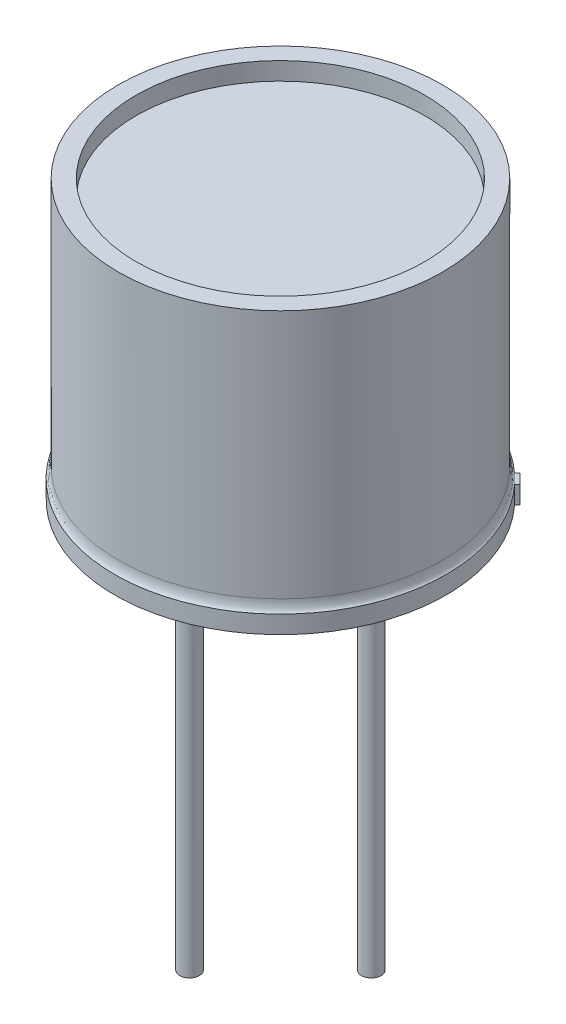
ISO-10303-21;
HEADER;
FILE_DESCRIPTION(('STEP AP214'),'2;1');
FILE_NAME('part.step','',(''),(''),'','','');
FILE_SCHEMA(('AUTOMOTIVE_DESIGN { 1 0 10303 214 1 1 1 1 }'));
ENDSEC;
DATA;
#1=APPLICATION_CONTEXT('core data for automotive mechanical design processes');
#2=APPLICATION_PROTOCOL_DEFINITION('international standard','automotive_design',2000,#1);
#3=PRODUCT_CONTEXT('',#1,'mechanical');
#4=PRODUCT('Part','Part','',(#3));
#5=PRODUCT_RELATED_PRODUCT_CATEGORY('part','',(#4));
#6=PRODUCT_DEFINITION_FORMATION('','',#4);
#7=PRODUCT_DEFINITION_CONTEXT('part definition',#1,'design');
#8=PRODUCT_DEFINITION('design','',#6,#7);
#9=PRODUCT_DEFINITION_SHAPE('','',#8);
#10=(LENGTH_UNIT() NAMED_UNIT(*) SI_UNIT(.MILLI.,.METRE.));
#11=(NAMED_UNIT(*) PLANE_ANGLE_UNIT() SI_UNIT($,.RADIAN.));
#12=(NAMED_UNIT(*) SI_UNIT($,.STERADIAN.) SOLID_ANGLE_UNIT());
#13=UNCERTAINTY_MEASURE_WITH_UNIT(LENGTH_MEASURE(1.E-05),#10,'distance_accuracy_value','');
#14=(GEOMETRIC_REPRESENTATION_CONTEXT(3) GLOBAL_UNCERTAINTY_ASSIGNED_CONTEXT((#13)) GLOBAL_UNIT_ASSIGNED_CONTEXT((#10,
#11,#12)) REPRESENTATION_CONTEXT('',''));
#15=CARTESIAN_POINT('',(0.,0.,0.));
#16=DIRECTION('',(0.,0.,1.));
#17=DIRECTION('',(1.,0.,0.));
#18=AXIS2_PLACEMENT_3D('',#15,#16,#17);
#19=CARTESIAN_POINT('',(0.,7.8,0.));
#20=DIRECTION('',(0.,-1.,0.));
#21=DIRECTION('',(0.,0.,-1.));
#22=AXIS2_PLACEMENT_3D('',#19,#20,#21);
#23=CYLINDRICAL_SURFACE('',#22,4.55);
#24=CARTESIAN_POINT('',(0.,0.8,-4.55));
#25=CARTESIAN_POINT('',(0.595593602652286,0.8,-4.55));
#26=CARTESIAN_POINT('',(1.19095287807611,0.8,-4.431575677084));
#27=CARTESIAN_POINT('',(2.2914663564462,0.8,-3.97572806876871));
#28=CARTESIAN_POINT('',(2.79618757913212,0.8,-3.63848412966547));
#29=CARTESIAN_POINT('',(3.63848412966547,0.8,-2.79618757913212));
#30=CARTESIAN_POINT('',(3.97572806876872,0.8,-2.2914663564462));
#31=CARTESIAN_POINT('',(4.431575677084,0.8,-1.19095287807611));
#32=CARTESIAN_POINT('',(4.55,0.8,-0.595593602652218));
#33=CARTESIAN_POINT('',(4.55,0.8,0.595593602652217));
#34=CARTESIAN_POINT('',(4.43157567708403,0.8,1.19095287807602));
#35=CARTESIAN_POINT('',(3.97572806876867,0.8,2.2914663564463));
#36=CARTESIAN_POINT('',(3.63848412966563,0.8,2.79618757913195));
#37=CARTESIAN_POINT('',(2.79618757913194,0.8,3.63848412966564));
#38=CARTESIAN_POINT('',(2.29146635644623,0.8,3.9757280687687));
#39=CARTESIAN_POINT('',(1.19095287807609,0.8,4.431575677084));
#40=CARTESIAN_POINT('',(0.595593602652218,0.8,4.55));
#41=CARTESIAN_POINT('',(-0.595593602652217,0.8,4.55));
#42=CARTESIAN_POINT('',(-1.19095287807599,0.8,4.43157567708405));
#43=CARTESIAN_POINT('',(-2.29146635644632,0.8,3.97572806876867));
#44=CARTESIAN_POINT('',(-2.79618757913195,0.8,3.63848412966563));
#45=CARTESIAN_POINT('',(-3.63848412966564,0.8,2.79618757913194));
#46=CARTESIAN_POINT('',(-3.9757280687687,0.8,2.29146635644623));
#47=CARTESIAN_POINT('',(-4.43157567708401,0.8,1.19095287807609));
#48=CARTESIAN_POINT('',(-4.55,0.8,0.595593602652211));
#49=CARTESIAN_POINT('',(-4.55,0.8,-0.595593602652225));
#50=CARTESIAN_POINT('',(-4.43157567708405,0.8,-1.19095287807599));
#51=CARTESIAN_POINT('',(-3.97572806876867,0.8,-2.29146635644632));
#52=CARTESIAN_POINT('',(-3.63848412966538,0.8,-2.7961875791322));
#53=CARTESIAN_POINT('',(-2.79618757913222,0.8,-3.63848412966536));
#54=CARTESIAN_POINT('',(-2.29146635644623,0.8,-3.9757280687687));
#55=CARTESIAN_POINT('',(-1.19095287807609,0.8,-4.43157567708401));
#56=CARTESIAN_POINT('',(-0.595593602652287,0.8,-4.55));
#57=CARTESIAN_POINT('',(0.,0.8,-4.55));
#58=(BOUNDED_CURVE() B_SPLINE_CURVE(3,(#24,#25,#26,#27,#28,#29,#30,#31,#32,#33,#34,#35,#36,#37,
#38,#39,#40,#41,#42,#43,#44,#45,#46,#47,#48,#49,#50,#51,#52,#53,#54,#55,#56,#57),.UNSPECIFIED.,
.T.,.F.) B_SPLINE_CURVE_WITH_KNOTS((4,2,2,2,2,2,2,2,2,2,2,2,2,2,2,2,4),(0.,0.392699081698724,
0.785398163397448,1.17809724509617,1.5707963267949,1.96349540849362,2.35619449019234,
2.74889357189107,3.14159265358979,3.53429173528852,3.92699081698724,4.31968989868597,
4.71238898038469,5.10508806208341,5.49778714378214,5.89048622548086,6.28318530717959),
.UNSPECIFIED.) CURVE() GEOMETRIC_REPRESENTATION_ITEM() RATIONAL_B_SPLINE_CURVE((1.,1.,1.,1.,1.,
1.,1.,1.,1.,1.,1.,1.,1.,1.,1.,1.,1.,1.,1.,1.,1.,1.,1.,1.,1.,1.,1.,1.,1.,1.,1.,1.,1.,1.)) REPRESENTATION_ITEM(''));
#59=CARTESIAN_POINT('',(0.,0.8,-4.55));
#60=VERTEX_POINT('',#59);
#61=EDGE_CURVE('E12',#60,#60,#58,.F.);
#62=ORIENTED_EDGE('',*,*,#61,.T.);
#63=EDGE_LOOP('',(#62));
#64=FACE_BOUND('',#63,.T.);
#65=CARTESIAN_POINT('',(0.,7.8,0.));
#66=DIRECTION('',(0.,1.,0.));
#67=DIRECTION('',(0.,0.,1.));
#68=AXIS2_PLACEMENT_3D('',#65,#66,#67);
#69=CIRCLE('',#68,4.55);
#70=CARTESIAN_POINT('',(0.,7.8,4.55));
#71=VERTEX_POINT('',#70);
#72=EDGE_CURVE('E195',#71,#71,#69,.T.);
#73=ORIENTED_EDGE('',*,*,#72,.F.);
#74=EDGE_LOOP('',(#73));
#75=FACE_BOUND('',#74,.T.);
#76=ADVANCED_FACE('F40',(#64,#75),#23,.T.);
#77=CARTESIAN_POINT('',(0.,7.8,0.));
#78=DIRECTION('',(0.,1.,0.));
#79=DIRECTION('',(0.,0.,1.));
#80=AXIS2_PLACEMENT_3D('',#77,#78,#79);
#81=PLANE('',#80);
#82=CARTESIAN_POINT('',(0.,7.8,0.));
#83=DIRECTION('',(0.,1.,0.));
#84=DIRECTION('',(0.,0.,1.));
#85=AXIS2_PLACEMENT_3D('',#82,#83,#84);
#86=CIRCLE('',#85,4.050000028);
#87=CARTESIAN_POINT('',(0.,7.8,4.050000028));
#88=VERTEX_POINT('',#87);
#89=EDGE_CURVE('E199',#88,#88,#86,.T.);
#90=ORIENTED_EDGE('',*,*,#89,.F.);
#91=EDGE_LOOP('',(#90));
#92=FACE_BOUND('',#91,.T.);
#93=ORIENTED_EDGE('',*,*,#72,.T.);
#94=EDGE_LOOP('',(#93));
#95=FACE_BOUND('',#94,.T.);
#96=ADVANCED_FACE('F239',(#92,#95),#81,.T.);
#97=CARTESIAN_POINT('',(0.,7.3,0.));
#98=DIRECTION('',(0.,1.,0.));
#99=DIRECTION('',(0.,0.,1.));
#100=AXIS2_PLACEMENT_3D('',#97,#98,#99);
#101=CYLINDRICAL_SURFACE('',#100,4.050000028);
#102=CARTESIAN_POINT('',(0.,7.3,0.));
#103=DIRECTION('',(0.,1.,0.));
#104=DIRECTION('',(0.,0.,1.));
#105=AXIS2_PLACEMENT_3D('',#102,#103,#104);
#106=CIRCLE('',#105,4.050000028);
#107=CARTESIAN_POINT('',(0.,7.3,4.050000028));
#108=VERTEX_POINT('',#107);
#109=EDGE_CURVE('E198',#108,#108,#106,.T.);
#110=ORIENTED_EDGE('',*,*,#109,.F.);
#111=EDGE_LOOP('',(#110));
#112=FACE_BOUND('',#111,.T.);
#113=ORIENTED_EDGE('',*,*,#89,.T.);
#114=EDGE_LOOP('',(#113));
#115=FACE_BOUND('',#114,.T.);
#116=ADVANCED_FACE('F243',(#112,#115),#101,.F.);
#117=CARTESIAN_POINT('',(0.,7.3,0.));
#118=DIRECTION('',(0.,1.,0.));
#119=DIRECTION('',(0.,0.,1.));
#120=AXIS2_PLACEMENT_3D('',#117,#118,#119);
#121=PLANE('',#120);
#122=ORIENTED_EDGE('',*,*,#109,.T.);
#123=EDGE_LOOP('',(#122));
#124=FACE_BOUND('',#123,.T.);
#125=ADVANCED_FACE('F148',(#124),#121,.T.);
#126=CARTESIAN_POINT('',(0.,0.5,0.));
#127=DIRECTION('',(0.,-1.,0.));
#128=DIRECTION('',(0.,0.,-1.));
#129=AXIS2_PLACEMENT_3D('',#126,#127,#128);
#130=CYLINDRICAL_SURFACE('',#129,4.65);
#131=DIRECTION('',(0.,-1.,0.));
#132=VECTOR('',#131,1.);
#133=CARTESIAN_POINT('',(3.14358274395477,0.5,-3.42642489074397));
#134=LINE('',#133,#132);
#135=CARTESIAN_POINT('',(3.14358274395477,0.,-3.42642489074397));
#136=VERTEX_POINT('',#135);
#137=CARTESIAN_POINT('',(3.14356671692941,0.5,-3.42641014549825));
#138=VERTEX_POINT('',#137);
#139=EDGE_CURVE('E66',#136,#138,#134,.F.);
#140=ORIENTED_EDGE('',*,*,#139,.F.);
#141=CARTESIAN_POINT('',(0.,0.,0.));
#142=DIRECTION('',(0.,-1.,0.));
#143=DIRECTION('',(0.,0.,-1.));
#144=AXIS2_PLACEMENT_3D('',#141,#142,#143);
#145=CIRCLE('',#144,4.65);
#146=CARTESIAN_POINT('',(3.42642489074397,0.,-3.14358274395477));
#147=VERTEX_POINT('',#146);
#148=EDGE_CURVE('E61',#147,#136,#145,.T.);
#149=ORIENTED_EDGE('',*,*,#148,.F.);
#150=DIRECTION('',(0.,-1.,0.));
#151=VECTOR('',#150,1.);
#152=CARTESIAN_POINT('',(3.42642489074397,0.5,-3.14358274395477));
#153=LINE('',#152,#151);
#154=CARTESIAN_POINT('',(3.42640953219442,0.5,-3.14356738540522));
#155=VERTEX_POINT('',#154);
#156=EDGE_CURVE('E125',#155,#147,#153,.T.);
#157=ORIENTED_EDGE('',*,*,#156,.F.);
#158=CARTESIAN_POINT('',(0.,0.5,-4.65));
#159=CARTESIAN_POINT('',(-0.608683571941348,0.5,-4.65));
#160=CARTESIAN_POINT('',(-1.21712766660527,0.5,-4.52897294471207));
#161=CARTESIAN_POINT('',(-2.34182825439008,0.5,-4.06310670764289));
#162=CARTESIAN_POINT('',(-2.85764225120103,0.5,-3.71845081383387));
#163=CARTESIAN_POINT('',(-3.71845081383389,0.5,-2.85764225120101));
#164=CARTESIAN_POINT('',(-4.06310670764263,0.5,-2.34182825439013));
#165=CARTESIAN_POINT('',(-4.52897294471234,0.5,-1.21712766660519));
#166=CARTESIAN_POINT('',(-4.65,0.5,-0.608683571941285));
#167=CARTESIAN_POINT('',(-4.65,0.5,0.608683571941271));
#168=CARTESIAN_POINT('',(-4.52897294471207,0.5,1.21712766660527));
#169=CARTESIAN_POINT('',(-4.06310670764289,0.5,2.34182825439008));
#170=CARTESIAN_POINT('',(-3.71845081383401,0.5,2.85764225120075));
#171=CARTESIAN_POINT('',(-2.85764225120089,0.5,3.71845081383414));
#172=CARTESIAN_POINT('',(-2.34182825439013,0.5,4.06310670764263));
#173=CARTESIAN_POINT('',(-1.21712766660519,0.5,4.52897294471234));
#174=CARTESIAN_POINT('',(-0.608683571941277,0.5,4.65));
#175=CARTESIAN_POINT('',(0.608683571941278,0.5,4.65));
#176=CARTESIAN_POINT('',(1.21712766660527,0.5,4.52897294471207));
#177=CARTESIAN_POINT('',(2.34182825439008,0.5,4.06310670764289));
#178=CARTESIAN_POINT('',(2.85764225120088,0.5,3.71845081383414));
#179=CARTESIAN_POINT('',(3.71845081383401,0.5,2.85764225120075));
#180=CARTESIAN_POINT('',(4.0631067076426,0.5,2.34182825439008));
#181=CARTESIAN_POINT('',(4.52897294471236,0.5,1.21712766660525));
#182=CARTESIAN_POINT('',(4.65,0.5,0.608683571941277));
#183=CARTESIAN_POINT('',(4.65,0.5,-0.608683571941278));
#184=CARTESIAN_POINT('',(4.5289729447121,0.5,-1.21712766660525));
#185=CARTESIAN_POINT('',(4.06310670764287,0.5,-2.34182825439008));
#186=CARTESIAN_POINT('',(3.71845081383396,0.5,-2.85764225120093));
#187=CARTESIAN_POINT('',(2.85764225120093,0.5,-3.71845081383396));
#188=CARTESIAN_POINT('',(2.34182825439008,0.5,-4.06310670764287));
#189=CARTESIAN_POINT('',(1.21712766660525,0.5,-4.5289729447121));
#190=CARTESIAN_POINT('',(0.608683571941347,0.5,-4.65));
#191=CARTESIAN_POINT('',(0.,0.5,-4.65));
#192=(BOUNDED_CURVE() B_SPLINE_CURVE(3,(#158,#159,#160,#161,#162,#163,#164,#165,#166,#167,#168,
#169,#170,#171,#172,#173,#174,#175,#176,#177,#178,#179,#180,#181,#182,#183,#184,#185,#186,#187,
#188,#189,#190,#191),.UNSPECIFIED.,.T.,.F.) B_SPLINE_CURVE_WITH_KNOTS((4,2,2,2,2,2,2,2,2,2,2,2,
2,2,2,2,4),(0.,0.392699081698725,0.785398163397448,1.17809724509617,1.5707963267949,
1.96349540849362,2.35619449019234,2.74889357189107,3.14159265358979,3.53429173528852,
3.92699081698724,4.31968989868597,4.71238898038469,5.10508806208341,5.49778714378214,
5.89048622548086,6.28318530717959),
.UNSPECIFIED.) CURVE() GEOMETRIC_REPRESENTATION_ITEM() RATIONAL_B_SPLINE_CURVE((1.,1.,1.,1.,1.,
1.,1.,1.,1.,1.,1.,1.,1.,1.,1.,1.,1.,1.,1.,1.,1.,1.,1.,1.,1.,1.,1.,1.,1.,1.,1.,1.,1.,1.)) REPRESENTATION_ITEM(''));
#193=EDGE_CURVE('E163',#155,#138,#192,.F.);
#194=ORIENTED_EDGE('',*,*,#193,.T.);
#195=EDGE_LOOP('',(#140,#149,#157,#194));
#196=FACE_BOUND('',#195,.T.);
#197=ADVANCED_FACE('F143',(#196),#130,.T.);
#198=CARTESIAN_POINT('',(0.,-10.16,-2.55));
#199=DIRECTION('',(0.,-1.,0.));
#200=DIRECTION('',(0.,0.,-1.));
#201=AXIS2_PLACEMENT_3D('',#198,#199,#200);
#202=PLANE('',#201);
#203=CARTESIAN_POINT('',(0.,-10.16,-2.55));
#204=DIRECTION('',(0.,-1.,0.));
#205=DIRECTION('',(0.,0.,-1.));
#206=AXIS2_PLACEMENT_3D('',#203,#204,#205);
#207=CIRCLE('',#206,0.275);
#208=CARTESIAN_POINT('',(0.,-10.16,-2.825));
#209=VERTEX_POINT('',#208);
#210=EDGE_CURVE('E202',#209,#209,#207,.T.);
#211=ORIENTED_EDGE('',*,*,#210,.T.);
#212=EDGE_LOOP('',(#211));
#213=FACE_BOUND('',#212,.T.);
#214=ADVANCED_FACE('F147',(#213),#202,.T.);
#215=CARTESIAN_POINT('',(-2.55000000000007,-10.16,0.));
#216=DIRECTION('',(0.,-1.,0.));
#217=DIRECTION('',(0.,0.,-1.));
#218=AXIS2_PLACEMENT_3D('',#215,#216,#217);
#219=PLANE('',#218);
#220=CARTESIAN_POINT('',(-2.55000000000007,-10.16,0.));
#221=DIRECTION('',(0.,-1.,0.));
#222=DIRECTION('',(0.,0.,-1.));
#223=AXIS2_PLACEMENT_3D('',#220,#221,#222);
#224=CIRCLE('',#223,0.275000000000056);
#225=CARTESIAN_POINT('',(-2.55000000000007,-10.16,-0.275000000000128));
#226=VERTEX_POINT('',#225);
#227=EDGE_CURVE('E207',#226,#226,#224,.T.);
#228=ORIENTED_EDGE('',*,*,#227,.T.);
#229=EDGE_LOOP('',(#228));
#230=FACE_BOUND('',#229,.T.);
#231=ADVANCED_FACE('F264',(#230),#219,.T.);
#232=CARTESIAN_POINT('',(-1.44326148227495E-13,-10.16,2.55));
#233=DIRECTION('',(0.,-1.,0.));
#234=DIRECTION('',(0.,0.,-1.));
#235=AXIS2_PLACEMENT_3D('',#232,#233,#234);
#236=PLANE('',#235);
#237=CARTESIAN_POINT('',(-1.44326148227495E-13,-10.16,2.55));
#238=DIRECTION('',(0.,-1.,0.));
#239=DIRECTION('',(0.,0.,-1.));
#240=AXIS2_PLACEMENT_3D('',#237,#238,#239);
#241=CIRCLE('',#240,0.275000000000155);
#242=CARTESIAN_POINT('',(-1.44326148227495E-13,-10.16,2.27499999999984));
#243=VERTEX_POINT('',#242);
#244=EDGE_CURVE('E210',#243,#243,#241,.T.);
#245=ORIENTED_EDGE('',*,*,#244,.T.);
#246=EDGE_LOOP('',(#245));
#247=FACE_BOUND('',#246,.T.);
#248=ADVANCED_FACE('F271',(#247),#236,.T.);
#249=CARTESIAN_POINT('',(2.54999999999993,-10.16,0.));
#250=DIRECTION('',(0.,-1.,0.));
#251=DIRECTION('',(0.,0.,-1.));
#252=AXIS2_PLACEMENT_3D('',#249,#250,#251);
#253=PLANE('',#252);
#254=CARTESIAN_POINT('',(2.54999999999993,-10.16,0.));
#255=DIRECTION('',(0.,-1.,0.));
#256=DIRECTION('',(0.,0.,-1.));
#257=AXIS2_PLACEMENT_3D('',#254,#255,#256);
#258=CIRCLE('',#257,0.275000000000116);
#259=CARTESIAN_POINT('',(2.54999999999993,-10.16,-0.275000000000044));
#260=VERTEX_POINT('',#259);
#261=EDGE_CURVE('E166',#260,#260,#258,.T.);
#262=ORIENTED_EDGE('',*,*,#261,.T.);
#263=EDGE_LOOP('',(#262));
#264=FACE_BOUND('',#263,.T.);
#265=ADVANCED_FACE('F149',(#264),#253,.T.);
#266=CARTESIAN_POINT('',(0.,-10.16,-2.55));
#267=DIRECTION('',(0.,1.,0.));
#268=DIRECTION('',(0.,0.,1.));
#269=AXIS2_PLACEMENT_3D('',#266,#267,#268);
#270=CYLINDRICAL_SURFACE('',#269,0.275);
#271=ORIENTED_EDGE('',*,*,#210,.F.);
#272=EDGE_LOOP('',(#271));
#273=FACE_BOUND('',#272,.T.);
#274=CARTESIAN_POINT('',(0.,0.,-2.55));
#275=DIRECTION('',(0.,1.,0.));
#276=DIRECTION('',(0.,0.,1.));
#277=AXIS2_PLACEMENT_3D('',#274,#275,#276);
#278=CIRCLE('',#277,0.275);
#279=CARTESIAN_POINT('',(0.,0.,-2.275));
#280=VERTEX_POINT('',#279);
#281=EDGE_CURVE('E192',#280,#280,#278,.F.);
#282=ORIENTED_EDGE('',*,*,#281,.T.);
#283=EDGE_LOOP('',(#282));
#284=FACE_BOUND('',#283,.T.);
#285=ADVANCED_FACE('F257',(#273,#284),#270,.T.);
#286=CARTESIAN_POINT('',(-2.55000000000007,-10.16,0.));
#287=DIRECTION('',(0.,1.,0.));
#288=DIRECTION('',(0.,0.,1.));
#289=AXIS2_PLACEMENT_3D('',#286,#287,#288);
#290=CYLINDRICAL_SURFACE('',#289,0.275000000000056);
#291=ORIENTED_EDGE('',*,*,#227,.F.);
#292=EDGE_LOOP('',(#291));
#293=FACE_BOUND('',#292,.T.);
#294=CARTESIAN_POINT('',(-2.55000000000007,0.,0.));
#295=DIRECTION('',(0.,1.,0.));
#296=DIRECTION('',(0.,0.,1.));
#297=AXIS2_PLACEMENT_3D('',#294,#295,#296);
#298=CIRCLE('',#297,0.275000000000056);
#299=CARTESIAN_POINT('',(-2.55000000000007,0.,0.274999999999984));
#300=VERTEX_POINT('',#299);
#301=EDGE_CURVE('E189',#300,#300,#298,.F.);
#302=ORIENTED_EDGE('',*,*,#301,.T.);
#303=EDGE_LOOP('',(#302));
#304=FACE_BOUND('',#303,.T.);
#305=ADVANCED_FACE('F260',(#293,#304),#290,.T.);
#306=CARTESIAN_POINT('',(-1.44326148227495E-13,-10.16,2.55));
#307=DIRECTION('',(0.,1.,0.));
#308=DIRECTION('',(0.,0.,1.));
#309=AXIS2_PLACEMENT_3D('',#306,#307,#308);
#310=CYLINDRICAL_SURFACE('',#309,0.275000000000155);
#311=ORIENTED_EDGE('',*,*,#244,.F.);
#312=EDGE_LOOP('',(#311));
#313=FACE_BOUND('',#312,.T.);
#314=CARTESIAN_POINT('',(-1.44326148227495E-13,0.,2.55));
#315=DIRECTION('',(0.,1.,0.));
#316=DIRECTION('',(0.,0.,1.));
#317=AXIS2_PLACEMENT_3D('',#314,#315,#316);
#318=CIRCLE('',#317,0.275000000000155);
#319=CARTESIAN_POINT('',(-1.44326148227495E-13,0.,2.82500000000015));
#320=VERTEX_POINT('',#319);
#321=EDGE_CURVE('E186',#320,#320,#318,.F.);
#322=ORIENTED_EDGE('',*,*,#321,.T.);
#323=EDGE_LOOP('',(#322));
#324=FACE_BOUND('',#323,.T.);
#325=ADVANCED_FACE('F233',(#313,#324),#310,.T.);
#326=CARTESIAN_POINT('',(2.54999999999993,-10.16,0.));
#327=DIRECTION('',(0.,1.,0.));
#328=DIRECTION('',(0.,0.,1.));
#329=AXIS2_PLACEMENT_3D('',#326,#327,#328);
#330=CYLINDRICAL_SURFACE('',#329,0.275000000000116);
#331=ORIENTED_EDGE('',*,*,#261,.F.);
#332=EDGE_LOOP('',(#331));
#333=FACE_BOUND('',#332,.T.);
#334=CARTESIAN_POINT('',(2.54999999999993,0.,0.));
#335=DIRECTION('',(0.,1.,0.));
#336=DIRECTION('',(0.,0.,1.));
#337=AXIS2_PLACEMENT_3D('',#334,#335,#336);
#338=CIRCLE('',#337,0.275000000000116);
#339=CARTESIAN_POINT('',(2.54999999999993,0.,0.275000000000189));
#340=VERTEX_POINT('',#339);
#341=EDGE_CURVE('E54',#340,#340,#338,.F.);
#342=ORIENTED_EDGE('',*,*,#341,.T.);
#343=EDGE_LOOP('',(#342));
#344=FACE_BOUND('',#343,.T.);
#345=ADVANCED_FACE('F226',(#333,#344),#330,.T.);
#346=CARTESIAN_POINT('',(0.,0.,0.));
#347=DIRECTION('',(0.,1.,0.));
#348=DIRECTION('',(0.,0.,1.));
#349=AXIS2_PLACEMENT_3D('',#346,#347,#348);
#350=PLANE('',#349);
#351=ORIENTED_EDGE('',*,*,#341,.F.);
#352=EDGE_LOOP('',(#351));
#353=FACE_BOUND('',#352,.T.);
#354=ORIENTED_EDGE('',*,*,#321,.F.);
#355=EDGE_LOOP('',(#354));
#356=FACE_BOUND('',#355,.T.);
#357=ORIENTED_EDGE('',*,*,#301,.F.);
#358=EDGE_LOOP('',(#357));
#359=FACE_BOUND('',#358,.T.);
#360=ORIENTED_EDGE('',*,*,#281,.F.);
#361=EDGE_LOOP('',(#360));
#362=FACE_BOUND('',#361,.T.);
#363=ORIENTED_EDGE('',*,*,#148,.T.);
#364=DIRECTION('',(0.70710678118655,0.,-0.707106781186545));
#365=VECTOR('',#364,1.);
#366=CARTESIAN_POINT('',(3.07591478100419,0.,-3.35875692779339));
#367=LINE('',#366,#365);
#368=CARTESIAN_POINT('',(3.2173361372415,0.,-3.5001782840307));
#369=VERTEX_POINT('',#368);
#370=EDGE_CURVE('E115',#136,#369,#367,.T.);
#371=ORIENTED_EDGE('',*,*,#370,.T.);
#372=DIRECTION('',(0.707106781186547,0.,0.707106781186547));
#373=VECTOR('',#372,1.);
#374=CARTESIAN_POINT('',(3.2173361372415,0.,-3.5001782840307));
#375=LINE('',#374,#373);
#376=CARTESIAN_POINT('',(3.5001782840307,0.,-3.2173361372415));
#377=VERTEX_POINT('',#376);
#378=EDGE_CURVE('E101',#369,#377,#375,.T.);
#379=ORIENTED_EDGE('',*,*,#378,.T.);
#380=DIRECTION('',(-0.70710678118655,0.,0.707106781186545));
#381=VECTOR('',#380,1.);
#382=CARTESIAN_POINT('',(3.5001782840307,0.,-3.2173361372415));
#383=LINE('',#382,#381);
#384=EDGE_CURVE('E95',#377,#147,#383,.T.);
#385=ORIENTED_EDGE('',*,*,#384,.T.);
#386=EDGE_LOOP('',(#363,#371,#379,#385));
#387=FACE_BOUND('',#386,.T.);
#388=ADVANCED_FACE('F224',(#353,#356,#359,#362,#387),#350,.F.);
#389=CARTESIAN_POINT('',(0.,0.5,-4.65));
#390=CARTESIAN_POINT('',(0.608683571941347,0.5,-4.65));
#391=CARTESIAN_POINT('',(1.21712766660525,0.5,-4.5289729447121));
#392=CARTESIAN_POINT('',(2.34182825439008,0.5,-4.06310670764287));
#393=CARTESIAN_POINT('',(2.85764225120093,0.5,-3.71845081383396));
#394=CARTESIAN_POINT('',(3.71845081383396,0.5,-2.85764225120093));
#395=CARTESIAN_POINT('',(4.06310670764287,0.5,-2.34182825439008));
#396=CARTESIAN_POINT('',(4.5289729447121,0.5,-1.21712766660525));
#397=CARTESIAN_POINT('',(4.65,0.5,-0.608683571941278));
#398=CARTESIAN_POINT('',(4.65,0.5,0.608683571941277));
#399=CARTESIAN_POINT('',(4.52897294471236,0.5,1.21712766660525));
#400=CARTESIAN_POINT('',(4.0631067076426,0.5,2.34182825439008));
#401=CARTESIAN_POINT('',(3.71845081383401,0.5,2.85764225120075));
#402=CARTESIAN_POINT('',(2.85764225120088,0.5,3.71845081383414));
#403=CARTESIAN_POINT('',(2.34182825439008,0.5,4.06310670764289));
#404=CARTESIAN_POINT('',(1.21712766660527,0.5,4.52897294471207));
#405=CARTESIAN_POINT('',(0.608683571941278,0.5,4.65));
#406=CARTESIAN_POINT('',(-0.608683571941277,0.5,4.65));
#407=CARTESIAN_POINT('',(-1.21712766660519,0.5,4.52897294471234));
#408=CARTESIAN_POINT('',(-2.34182825439013,0.5,4.06310670764263));
#409=CARTESIAN_POINT('',(-2.85764225120089,0.5,3.71845081383414));
#410=CARTESIAN_POINT('',(-3.71845081383401,0.5,2.85764225120075));
#411=CARTESIAN_POINT('',(-4.06310670764289,0.5,2.34182825439008));
#412=CARTESIAN_POINT('',(-4.52897294471207,0.5,1.21712766660527));
#413=CARTESIAN_POINT('',(-4.65,0.5,0.608683571941271));
#414=CARTESIAN_POINT('',(-4.65,0.5,-0.608683571941285));
#415=CARTESIAN_POINT('',(-4.52897294471234,0.5,-1.21712766660519));
#416=CARTESIAN_POINT('',(-4.06310670764263,0.5,-2.34182825439013));
#417=CARTESIAN_POINT('',(-3.71845081383389,0.5,-2.85764225120101));
#418=CARTESIAN_POINT('',(-2.85764225120103,0.5,-3.71845081383387));
#419=CARTESIAN_POINT('',(-2.34182825439008,0.5,-4.06310670764289));
#420=CARTESIAN_POINT('',(-1.21712766660527,0.5,-4.52897294471207));
#421=CARTESIAN_POINT('',(-0.608683571941348,0.5,-4.65));
#422=CARTESIAN_POINT('',(0.,0.5,-4.65));
#423=CARTESIAN_POINT('',(0.,0.5,-4.55));
#424=CARTESIAN_POINT('',(0.595593602652286,0.499999999999967,-4.55));
#425=CARTESIAN_POINT('',(1.19095287807611,0.5,-4.43157567708399));
#426=CARTESIAN_POINT('',(2.29146635644621,0.5,-3.97572806876872));
#427=CARTESIAN_POINT('',(2.79618757913212,0.5,-3.63848412966547));
#428=CARTESIAN_POINT('',(3.63848412966547,0.5,-2.79618757913212));
#429=CARTESIAN_POINT('',(3.97572806876872,0.5,-2.29146635644627));
#430=CARTESIAN_POINT('',(4.43157567708399,0.5,-1.19095287807604));
#431=CARTESIAN_POINT('',(4.55,0.499999999999967,-0.595593602652218));
#432=CARTESIAN_POINT('',(4.55,0.500000000000033,0.595593602652217));
#433=CARTESIAN_POINT('',(4.43157567708426,0.5,1.19095287807611));
#434=CARTESIAN_POINT('',(3.97572806876845,0.5,2.29146635644621));
#435=CARTESIAN_POINT('',(3.6384841296655,0.5,2.79618757913182));
#436=CARTESIAN_POINT('',(2.79618757913208,0.5,3.63848412966577));
#437=CARTESIAN_POINT('',(2.29146635644625,0.5,3.97572806876874));
#438=CARTESIAN_POINT('',(1.19095287807608,0.5,4.43157567708396));
#439=CARTESIAN_POINT('',(0.595593602652218,0.5,4.55));
#440=CARTESIAN_POINT('',(-0.595593602652217,0.5,4.55));
#441=CARTESIAN_POINT('',(-1.19095287807606,0.5,4.43157567708423));
#442=CARTESIAN_POINT('',(-2.29146635644624,0.5,3.97572806876848));
#443=CARTESIAN_POINT('',(-2.79618757913195,0.5,3.63848412966563));
#444=CARTESIAN_POINT('',(-3.63848412966564,0.5,2.79618757913194));
#445=CARTESIAN_POINT('',(-3.97572806876874,0.5,2.29146635644625));
#446=CARTESIAN_POINT('',(-4.43157567708396,0.5,1.19095287807608));
#447=CARTESIAN_POINT('',(-4.55,0.499999999999967,0.595593602652211));
#448=CARTESIAN_POINT('',(-4.55,0.500000000000033,-0.595593602652225));
#449=CARTESIAN_POINT('',(-4.43157567708423,0.5,-1.19095287807606));
#450=CARTESIAN_POINT('',(-3.97572806876848,0.5,-2.29146635644624));
#451=CARTESIAN_POINT('',(-3.63848412966538,0.500000000000067,-2.7961875791322));
#452=CARTESIAN_POINT('',(-2.79618757913222,0.499999999999934,-3.63848412966536));
#453=CARTESIAN_POINT('',(-2.29146635644632,0.5,-3.97572806876874));
#454=CARTESIAN_POINT('',(-1.19095287807601,0.5,-4.43157567708396));
#455=CARTESIAN_POINT('',(-0.595593602652287,0.500000000000033,-4.55));
#456=CARTESIAN_POINT('',(0.,0.5,-4.55));
#457=CARTESIAN_POINT('',(0.,0.8,-4.55));
#458=CARTESIAN_POINT('',(0.595593602652286,0.8,-4.55));
#459=CARTESIAN_POINT('',(1.19095287807611,0.8,-4.431575677084));
#460=CARTESIAN_POINT('',(2.2914663564462,0.8,-3.97572806876871));
#461=CARTESIAN_POINT('',(2.79618757913212,0.8,-3.63848412966547));
#462=CARTESIAN_POINT('',(3.63848412966547,0.8,-2.79618757913212));
#463=CARTESIAN_POINT('',(3.97572806876872,0.8,-2.2914663564462));
#464=CARTESIAN_POINT('',(4.431575677084,0.8,-1.19095287807611));
#465=CARTESIAN_POINT('',(4.55,0.8,-0.595593602652218));
#466=CARTESIAN_POINT('',(4.55,0.8,0.595593602652217));
#467=CARTESIAN_POINT('',(4.43157567708403,0.8,1.19095287807602));
#468=CARTESIAN_POINT('',(3.97572806876867,0.8,2.2914663564463));
#469=CARTESIAN_POINT('',(3.63848412966563,0.8,2.79618757913195));
#470=CARTESIAN_POINT('',(2.79618757913194,0.8,3.63848412966564));
#471=CARTESIAN_POINT('',(2.29146635644623,0.8,3.9757280687687));
#472=CARTESIAN_POINT('',(1.19095287807609,0.8,4.431575677084));
#473=CARTESIAN_POINT('',(0.595593602652218,0.8,4.55));
#474=CARTESIAN_POINT('',(-0.595593602652217,0.8,4.55));
#475=CARTESIAN_POINT('',(-1.19095287807599,0.8,4.43157567708405));
#476=CARTESIAN_POINT('',(-2.29146635644632,0.8,3.97572806876867));
#477=CARTESIAN_POINT('',(-2.79618757913195,0.8,3.63848412966563));
#478=CARTESIAN_POINT('',(-3.63848412966564,0.8,2.79618757913194));
#479=CARTESIAN_POINT('',(-3.9757280687687,0.8,2.29146635644623));
#480=CARTESIAN_POINT('',(-4.43157567708401,0.8,1.19095287807609));
#481=CARTESIAN_POINT('',(-4.55,0.8,0.595593602652211));
#482=CARTESIAN_POINT('',(-4.55,0.8,-0.595593602652225));
#483=CARTESIAN_POINT('',(-4.43157567708405,0.8,-1.19095287807599));
#484=CARTESIAN_POINT('',(-3.97572806876867,0.8,-2.29146635644632));
#485=CARTESIAN_POINT('',(-3.63848412966538,0.8,-2.7961875791322));
#486=CARTESIAN_POINT('',(-2.79618757913222,0.8,-3.63848412966536));
#487=CARTESIAN_POINT('',(-2.29146635644623,0.8,-3.9757280687687));
#488=CARTESIAN_POINT('',(-1.19095287807609,0.8,-4.43157567708401));
#489=CARTESIAN_POINT('',(-0.595593602652287,0.8,-4.55));
#490=CARTESIAN_POINT('',(0.,0.8,-4.55));
#491=(BOUNDED_SURFACE() B_SPLINE_SURFACE(2,3,((#389,#390,#391,#392,#393,#394,#395,#396,#397,
#398,#399,#400,#401,#402,#403,#404,#405,#406,#407,#408,#409,#410,#411,#412,#413,#414,#415,#416,
#417,#418,#419,#420,#421,#422),(#423,#424,#425,#426,#427,#428,#429,#430,#431,#432,#433,#434,
#435,#436,#437,#438,#439,#440,#441,#442,#443,#444,#445,#446,#447,#448,#449,#450,#451,#452,#453,
#454,#455,#456),(#457,#458,#459,#460,#461,#462,#463,#464,#465,#466,#467,#468,#469,#470,#471,
#472,#473,#474,#475,#476,#477,#478,#479,#480,#481,#482,#483,#484,#485,#486,#487,#488,#489,
#490)),.UNSPECIFIED.,.F.,.T.,.F.) B_SPLINE_SURFACE_WITH_KNOTS((3,3),(4,2,2,2,2,2,2,2,2,2,2,2,2,
2,2,2,4),(0.,1.),(0.,0.392699081698724,0.785398163397448,1.17809724509617,1.5707963267949,
1.96349540849362,2.35619449019234,2.74889357189107,3.14159265358979,3.53429173528852,
3.92699081698724,4.31968989868597,4.71238898038469,5.10508806208341,5.49778714378214,
5.89048622548086,6.28318530717959),
.UNSPECIFIED.) GEOMETRIC_REPRESENTATION_ITEM() RATIONAL_B_SPLINE_SURFACE(((1.,1.,1.,1.,1.,1.,1.,
1.,1.,1.,1.,1.,1.,1.,1.,1.,1.,1.,1.,1.,1.,1.,1.,1.,1.,1.,1.,1.,1.,1.,1.,1.,1.,1.),
(0.707106781186548,0.707106781186548,0.707106781186548,0.707106781186548,0.707106781186548,
0.707106781186548,0.707106781186548,0.707106781186548,0.707106781186548,0.707106781186548,
0.707106781186548,0.707106781186548,0.707106781186548,0.707106781186548,0.707106781186547,
0.707106781186547,0.707106781186548,0.707106781186548,0.707106781186548,0.707106781186548,
0.707106781186547,0.707106781186547,0.707106781186548,0.707106781186548,0.707106781186548,
0.707106781186548,0.707106781186548,0.707106781186548,0.707106781186548,0.707106781186548,
0.707106781186548,0.707106781186548,0.707106781186548,0.707106781186548),(1.,1.,1.,1.,1.,1.,1.,
1.,1.,1.,1.,1.,1.,1.,1.,1.,1.,1.,1.,1.,1.,1.,1.,1.,1.,1.,1.,1.,1.,1.,1.,1.,1.,1.))) REPRESENTATION_ITEM('') SURFACE());
#492=CARTESIAN_POINT('',(0.,0.5,-4.65));
#493=CARTESIAN_POINT('',(-0.608683571941348,0.5,-4.65));
#494=CARTESIAN_POINT('',(-1.21712766660527,0.5,-4.52897294471207));
#495=CARTESIAN_POINT('',(-2.34182825439008,0.5,-4.06310670764289));
#496=CARTESIAN_POINT('',(-2.85764225120103,0.5,-3.71845081383387));
#497=CARTESIAN_POINT('',(-3.71845081383389,0.5,-2.85764225120101));
#498=CARTESIAN_POINT('',(-4.06310670764263,0.5,-2.34182825439013));
#499=CARTESIAN_POINT('',(-4.52897294471234,0.5,-1.21712766660519));
#500=CARTESIAN_POINT('',(-4.65,0.5,-0.608683571941285));
#501=CARTESIAN_POINT('',(-4.65,0.5,0.608683571941271));
#502=CARTESIAN_POINT('',(-4.52897294471207,0.5,1.21712766660527));
#503=CARTESIAN_POINT('',(-4.06310670764289,0.5,2.34182825439008));
#504=CARTESIAN_POINT('',(-3.71845081383401,0.5,2.85764225120075));
#505=CARTESIAN_POINT('',(-2.85764225120089,0.5,3.71845081383414));
#506=CARTESIAN_POINT('',(-2.34182825439013,0.5,4.06310670764263));
#507=CARTESIAN_POINT('',(-1.21712766660519,0.5,4.52897294471234));
#508=CARTESIAN_POINT('',(-0.608683571941277,0.5,4.65));
#509=CARTESIAN_POINT('',(0.608683571941278,0.5,4.65));
#510=CARTESIAN_POINT('',(1.21712766660527,0.5,4.52897294471207));
#511=CARTESIAN_POINT('',(2.34182825439008,0.5,4.06310670764289));
#512=CARTESIAN_POINT('',(2.85764225120088,0.5,3.71845081383414));
#513=CARTESIAN_POINT('',(3.71845081383401,0.5,2.85764225120075));
#514=CARTESIAN_POINT('',(4.0631067076426,0.5,2.34182825439008));
#515=CARTESIAN_POINT('',(4.52897294471236,0.5,1.21712766660525));
#516=CARTESIAN_POINT('',(4.65,0.5,0.608683571941277));
#517=CARTESIAN_POINT('',(4.65,0.5,-0.608683571941278));
#518=CARTESIAN_POINT('',(4.5289729447121,0.5,-1.21712766660525));
#519=CARTESIAN_POINT('',(4.06310670764287,0.5,-2.34182825439008));
#520=CARTESIAN_POINT('',(3.71845081383396,0.5,-2.85764225120093));
#521=CARTESIAN_POINT('',(2.85764225120093,0.5,-3.71845081383396));
#522=CARTESIAN_POINT('',(2.34182825439008,0.5,-4.06310670764287));
#523=CARTESIAN_POINT('',(1.21712766660525,0.5,-4.5289729447121));
#524=CARTESIAN_POINT('',(0.608683571941347,0.5,-4.65));
#525=CARTESIAN_POINT('',(0.,0.5,-4.65));
#526=(BOUNDED_CURVE() B_SPLINE_CURVE(3,(#492,#493,#494,#495,#496,#497,#498,#499,#500,#501,#502,
#503,#504,#505,#506,#507,#508,#509,#510,#511,#512,#513,#514,#515,#516,#517,#518,#519,#520,#521,
#522,#523,#524,#525),.UNSPECIFIED.,.T.,.F.) B_SPLINE_CURVE_WITH_KNOTS((4,2,2,2,2,2,2,2,2,2,2,2,
2,2,2,2,4),(0.,0.392699081698725,0.785398163397448,1.17809724509617,1.5707963267949,
1.96349540849362,2.35619449019234,2.74889357189107,3.14159265358979,3.53429173528852,
3.92699081698724,4.31968989868597,4.71238898038469,5.10508806208341,5.49778714378214,
5.89048622548086,6.28318530717959),
.UNSPECIFIED.) CURVE() GEOMETRIC_REPRESENTATION_ITEM() RATIONAL_B_SPLINE_CURVE((1.,1.,1.,1.,1.,
1.,1.,1.,1.,1.,1.,1.,1.,1.,1.,1.,1.,1.,1.,1.,1.,1.,1.,1.,1.,1.,1.,1.,1.,1.,1.,1.,1.,1.)) REPRESENTATION_ITEM(''));
#527=EDGE_CURVE('E120',#138,#155,#526,.F.);
#528=ORIENTED_EDGE('',*,*,#61,.F.);
#529=EDGE_LOOP('',(#528));
#530=FACE_BOUND('',#529,.T.);
#531=ORIENTED_EDGE('',*,*,#527,.F.);
#532=ORIENTED_EDGE('',*,*,#193,.F.);
#533=EDGE_LOOP('',(#531,#532));
#534=FACE_BOUND('',#533,.T.);
#535=ADVANCED_FACE('F43',(#530,#534),#491,.T.);
#536=CARTESIAN_POINT('',(3.07591478100419,0.5,-3.35875692779339));
#537=DIRECTION('',(-0.707106781186545,0.,-0.70710678118655));
#538=DIRECTION('',(-0.70710678118655,0.,0.707106781186545));
#539=AXIS2_PLACEMENT_3D('',#536,#537,#538);
#540=PLANE('',#539);
#541=ORIENTED_EDGE('',*,*,#370,.F.);
#542=ORIENTED_EDGE('',*,*,#139,.T.);
#543=DIRECTION('',(0.70710678118655,0.,-0.707106781186545));
#544=VECTOR('',#543,1.);
#545=CARTESIAN_POINT('',(3.07591478100419,0.5,-3.35875692779339));
#546=LINE('',#545,#544);
#547=CARTESIAN_POINT('',(3.2173361372415,0.5,-3.5001782840307));
#548=VERTEX_POINT('',#547);
#549=EDGE_CURVE('E85',#138,#548,#546,.T.);
#550=ORIENTED_EDGE('',*,*,#549,.T.);
#551=DIRECTION('',(0.,-1.,0.));
#552=VECTOR('',#551,1.);
#553=CARTESIAN_POINT('',(3.2173361372415,0.5,-3.5001782840307));
#554=LINE('',#553,#552);
#555=EDGE_CURVE('E89',#548,#369,#554,.T.);
#556=ORIENTED_EDGE('',*,*,#555,.T.);
#557=EDGE_LOOP('',(#541,#542,#550,#556));
#558=FACE_BOUND('',#557,.T.);
#559=ADVANCED_FACE('F88',(#558),#540,.T.);
#560=CARTESIAN_POINT('',(3.5001782840307,0.5,-3.2173361372415));
#561=DIRECTION('',(0.707106781186545,0.,0.70710678118655));
#562=DIRECTION('',(0.70710678118655,0.,-0.707106781186545));
#563=AXIS2_PLACEMENT_3D('',#560,#561,#562);
#564=PLANE('',#563);
#565=DIRECTION('',(-0.70710678118655,0.,0.707106781186545));
#566=VECTOR('',#565,1.);
#567=CARTESIAN_POINT('',(3.5001782840307,0.5,-3.2173361372415));
#568=LINE('',#567,#566);
#569=CARTESIAN_POINT('',(3.5001782840307,0.5,-3.2173361372415));
#570=VERTEX_POINT('',#569);
#571=EDGE_CURVE('E103',#570,#155,#568,.T.);
#572=ORIENTED_EDGE('',*,*,#571,.T.);
#573=ORIENTED_EDGE('',*,*,#156,.T.);
#574=ORIENTED_EDGE('',*,*,#384,.F.);
#575=DIRECTION('',(0.,-1.,0.));
#576=VECTOR('',#575,1.);
#577=CARTESIAN_POINT('',(3.5001782840307,0.5,-3.2173361372415));
#578=LINE('',#577,#576);
#579=EDGE_CURVE('E102',#570,#377,#578,.T.);
#580=ORIENTED_EDGE('',*,*,#579,.F.);
#581=EDGE_LOOP('',(#572,#573,#574,#580));
#582=FACE_BOUND('',#581,.T.);
#583=ADVANCED_FACE('F135',(#582),#564,.T.);
#584=CARTESIAN_POINT('',(3.2173361372415,0.5,-3.5001782840307));
#585=DIRECTION('',(0.707106781186547,0.,-0.707106781186547));
#586=DIRECTION('',(-0.707106781186548,0.,-0.707106781186548));
#587=AXIS2_PLACEMENT_3D('',#584,#585,#586);
#588=PLANE('',#587);
#589=ORIENTED_EDGE('',*,*,#378,.F.);
#590=ORIENTED_EDGE('',*,*,#555,.F.);
#591=DIRECTION('',(0.707106781186547,0.,0.707106781186547));
#592=VECTOR('',#591,1.);
#593=CARTESIAN_POINT('',(3.2173361372415,0.5,-3.5001782840307));
#594=LINE('',#593,#592);
#595=EDGE_CURVE('E94',#548,#570,#594,.T.);
#596=ORIENTED_EDGE('',*,*,#595,.T.);
#597=ORIENTED_EDGE('',*,*,#579,.T.);
#598=EDGE_LOOP('',(#589,#590,#596,#597));
#599=FACE_BOUND('',#598,.T.);
#600=ADVANCED_FACE('F99',(#599),#588,.T.);
#601=CARTESIAN_POINT('',(0.,0.5,0.));
#602=DIRECTION('',(0.,-1.,0.));
#603=DIRECTION('',(0.,0.,-1.));
#604=AXIS2_PLACEMENT_3D('',#601,#602,#603);
#605=PLANE('',#604);
#606=ORIENTED_EDGE('',*,*,#527,.T.);
#607=ORIENTED_EDGE('',*,*,#571,.F.);
#608=ORIENTED_EDGE('',*,*,#595,.F.);
#609=ORIENTED_EDGE('',*,*,#549,.F.);
#610=EDGE_LOOP('',(#606,#607,#608,#609));
#611=FACE_BOUND('',#610,.T.);
#612=ADVANCED_FACE('F106',(#611),#605,.F.);
#613=CLOSED_SHELL('',(#76,#96,#116,#125,#197,#214,#231,#248,#265,#285,#305,#325,#345,#388,#535,
#559,#583,#600,#612));
#614=MANIFOLD_SOLID_BREP('B2',#613);
#615=ADVANCED_BREP_SHAPE_REPRESENTATION('',(#18,#614),#14);
#616=SHAPE_DEFINITION_REPRESENTATION(#9,#615);
ENDSEC;
END-ISO-10303-21;
